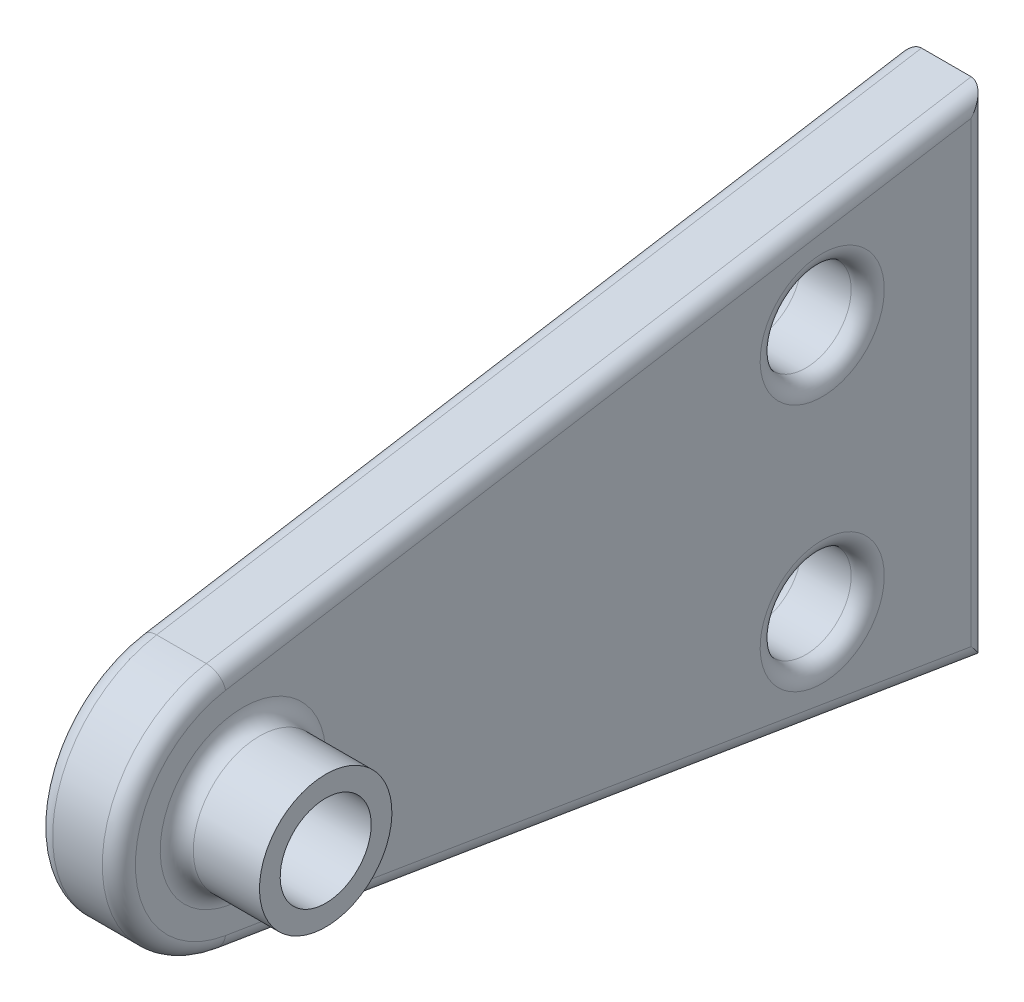
ISO-10303-21;
HEADER;
FILE_DESCRIPTION(('STEP AP214'),'2;1');
FILE_NAME('part.step','',(''),(''),'','','');
FILE_SCHEMA(('AUTOMOTIVE_DESIGN { 1 0 10303 214 1 1 1 1 }'));
ENDSEC;
DATA;
#1=APPLICATION_CONTEXT('core data for automotive mechanical design processes');
#2=APPLICATION_PROTOCOL_DEFINITION('international standard','automotive_design',2000,#1);
#3=PRODUCT_CONTEXT('',#1,'mechanical');
#4=PRODUCT('Part','Part','',(#3));
#5=PRODUCT_RELATED_PRODUCT_CATEGORY('part','',(#4));
#6=PRODUCT_DEFINITION_FORMATION('','',#4);
#7=PRODUCT_DEFINITION_CONTEXT('part definition',#1,'design');
#8=PRODUCT_DEFINITION('design','',#6,#7);
#9=PRODUCT_DEFINITION_SHAPE('','',#8);
#10=(LENGTH_UNIT() NAMED_UNIT(*) SI_UNIT(.MILLI.,.METRE.));
#11=(NAMED_UNIT(*) PLANE_ANGLE_UNIT() SI_UNIT($,.RADIAN.));
#12=(NAMED_UNIT(*) SI_UNIT($,.STERADIAN.) SOLID_ANGLE_UNIT());
#13=UNCERTAINTY_MEASURE_WITH_UNIT(LENGTH_MEASURE(1.E-05),#10,'distance_accuracy_value','');
#14=(GEOMETRIC_REPRESENTATION_CONTEXT(3) GLOBAL_UNCERTAINTY_ASSIGNED_CONTEXT((#13)) GLOBAL_UNIT_ASSIGNED_CONTEXT((#10,
#11,#12)) REPRESENTATION_CONTEXT('',''));
#15=CARTESIAN_POINT('',(0.,0.,0.));
#16=DIRECTION('',(0.,0.,1.));
#17=DIRECTION('',(1.,0.,0.));
#18=AXIS2_PLACEMENT_3D('',#15,#16,#17);
#19=CARTESIAN_POINT('',(5.,0.,45.));
#20=DIRECTION('',(-1.,0.,0.));
#21=DIRECTION('',(0.,1.,0.));
#22=AXIS2_PLACEMENT_3D('',#19,#20,#21);
#23=CYLINDRICAL_SURFACE('',#22,2.75);
#24=DIRECTION('',(1.,0.,0.));
#25=VECTOR('',#24,1.);
#26=CARTESIAN_POINT('',(5.,2.75,45.));
#27=LINE('',#26,#25);
#28=CARTESIAN_POINT('',(5.,2.75,45.));
#29=VERTEX_POINT('',#28);
#30=CARTESIAN_POINT('',(10.,2.75,45.));
#31=VERTEX_POINT('',#30);
#32=EDGE_CURVE('E10',#29,#31,#27,.T.);
#33=ORIENTED_EDGE('',*,*,#32,.T.);
#34=CARTESIAN_POINT('',(10.,0.,45.));
#35=DIRECTION('',(1.,0.,0.));
#36=DIRECTION('',(0.,1.,0.));
#37=AXIS2_PLACEMENT_3D('',#34,#35,#36);
#38=CIRCLE('',#37,2.75);
#39=EDGE_CURVE('E24',#31,#31,#38,.T.);
#40=ORIENTED_EDGE('',*,*,#39,.T.);
#41=ORIENTED_EDGE('',*,*,#32,.F.);
#42=CARTESIAN_POINT('',(5.,0.,45.));
#43=DIRECTION('',(1.,0.,0.));
#44=DIRECTION('',(0.,1.,0.));
#45=AXIS2_PLACEMENT_3D('',#42,#43,#44);
#46=CIRCLE('',#45,2.75);
#47=EDGE_CURVE('E371',#29,#29,#46,.T.);
#48=ORIENTED_EDGE('',*,*,#47,.F.);
#49=EDGE_LOOP('',(#33,#40,#41,#48));
#50=FACE_BOUND('',#49,.T.);
#51=ADVANCED_FACE('F16',(#50),#23,.F.);
#52=CARTESIAN_POINT('',(10.,0.,45.));
#53=DIRECTION('',(1.,0.,0.));
#54=DIRECTION('',(0.,-1.,0.));
#55=AXIS2_PLACEMENT_3D('',#52,#53,#54);
#56=PLANE('',#55);
#57=ORIENTED_EDGE('',*,*,#39,.F.);
#58=EDGE_LOOP('',(#57));
#59=FACE_BOUND('',#58,.T.);
#60=CARTESIAN_POINT('',(10.,0.,45.));
#61=DIRECTION('',(1.,0.,0.));
#62=DIRECTION('',(0.,1.,0.));
#63=AXIS2_PLACEMENT_3D('',#60,#61,#62);
#64=CIRCLE('',#63,4.);
#65=CARTESIAN_POINT('',(10.,4.,45.));
#66=VERTEX_POINT('',#65);
#67=EDGE_CURVE('E264',#66,#66,#64,.T.);
#68=ORIENTED_EDGE('',*,*,#67,.T.);
#69=EDGE_LOOP('',(#68));
#70=FACE_BOUND('',#69,.T.);
#71=ADVANCED_FACE('F378',(#59,#70),#56,.T.);
#72=CARTESIAN_POINT('',(0.,0.,45.));
#73=DIRECTION('',(-1.,0.,0.));
#74=DIRECTION('',(0.,1.,0.));
#75=AXIS2_PLACEMENT_3D('',#72,#73,#74);
#76=CYLINDRICAL_SURFACE('',#75,2.75);
#77=DIRECTION('',(1.,0.,0.));
#78=VECTOR('',#77,1.);
#79=CARTESIAN_POINT('',(0.,2.75,45.));
#80=LINE('',#79,#78);
#81=CARTESIAN_POINT('',(1.,2.75,45.));
#82=VERTEX_POINT('',#81);
#83=EDGE_CURVE('E301',#82,#29,#80,.T.);
#84=ORIENTED_EDGE('',*,*,#83,.T.);
#85=ORIENTED_EDGE('',*,*,#47,.T.);
#86=ORIENTED_EDGE('',*,*,#83,.F.);
#87=CARTESIAN_POINT('',(1.,0.,45.));
#88=DIRECTION('',(1.,0.,0.));
#89=DIRECTION('',(0.,1.,0.));
#90=AXIS2_PLACEMENT_3D('',#87,#88,#89);
#91=CIRCLE('',#90,2.75);
#92=EDGE_CURVE('E350',#82,#82,#91,.T.);
#93=ORIENTED_EDGE('',*,*,#92,.F.);
#94=EDGE_LOOP('',(#84,#85,#86,#93));
#95=FACE_BOUND('',#94,.T.);
#96=ADVANCED_FACE('F381',(#95),#76,.F.);
#97=CARTESIAN_POINT('',(5.,0.,45.));
#98=DIRECTION('',(-1.,0.,0.));
#99=DIRECTION('',(0.,1.,0.));
#100=AXIS2_PLACEMENT_3D('',#97,#98,#99);
#101=CYLINDRICAL_SURFACE('',#100,4.);
#102=CARTESIAN_POINT('',(6.,0.,45.));
#103=DIRECTION('',(1.,0.,0.));
#104=DIRECTION('',(0.,1.,0.));
#105=AXIS2_PLACEMENT_3D('',#102,#103,#104);
#106=CIRCLE('',#105,4.);
#107=CARTESIAN_POINT('',(6.,4.,45.));
#108=VERTEX_POINT('',#107);
#109=EDGE_CURVE('E346',#108,#108,#106,.T.);
#110=ORIENTED_EDGE('',*,*,#109,.T.);
#111=DIRECTION('',(1.,0.,0.));
#112=VECTOR('',#111,1.);
#113=CARTESIAN_POINT('',(5.,4.,45.));
#114=LINE('',#113,#112);
#115=EDGE_CURVE('E261',#108,#66,#114,.T.);
#116=ORIENTED_EDGE('',*,*,#115,.T.);
#117=ORIENTED_EDGE('',*,*,#67,.F.);
#118=ORIENTED_EDGE('',*,*,#115,.F.);
#119=EDGE_LOOP('',(#110,#116,#117,#118));
#120=FACE_BOUND('',#119,.T.);
#121=ADVANCED_FACE('F384',(#120),#101,.T.);
#122=CARTESIAN_POINT('',(0.,-7.5,10.));
#123=DIRECTION('',(-1.,0.,0.));
#124=DIRECTION('',(0.,1.,0.));
#125=AXIS2_PLACEMENT_3D('',#122,#123,#124);
#126=CYLINDRICAL_SURFACE('',#125,2.75);
#127=DIRECTION('',(1.,0.,0.));
#128=VECTOR('',#127,1.);
#129=CARTESIAN_POINT('',(0.,-4.75,10.));
#130=LINE('',#129,#128);
#131=CARTESIAN_POINT('',(1.,-4.75,10.));
#132=VERTEX_POINT('',#131);
#133=CARTESIAN_POINT('',(4.,-4.75,10.));
#134=VERTEX_POINT('',#133);
#135=EDGE_CURVE('E155',#132,#134,#130,.T.);
#136=ORIENTED_EDGE('',*,*,#135,.T.);
#137=CARTESIAN_POINT('',(4.,-7.5,10.));
#138=DIRECTION('',(1.,0.,0.));
#139=DIRECTION('',(0.,1.,0.));
#140=AXIS2_PLACEMENT_3D('',#137,#138,#139);
#141=CIRCLE('',#140,2.75);
#142=EDGE_CURVE('E342',#134,#134,#141,.T.);
#143=ORIENTED_EDGE('',*,*,#142,.T.);
#144=ORIENTED_EDGE('',*,*,#135,.F.);
#145=CARTESIAN_POINT('',(1.,-7.5,10.));
#146=DIRECTION('',(1.,0.,0.));
#147=DIRECTION('',(0.,1.,0.));
#148=AXIS2_PLACEMENT_3D('',#145,#146,#147);
#149=CIRCLE('',#148,2.75);
#150=EDGE_CURVE('E221',#132,#132,#149,.T.);
#151=ORIENTED_EDGE('',*,*,#150,.F.);
#152=EDGE_LOOP('',(#136,#143,#144,#151));
#153=FACE_BOUND('',#152,.T.);
#154=ADVANCED_FACE('F765',(#153),#126,.F.);
#155=CARTESIAN_POINT('',(0.,7.5,10.));
#156=DIRECTION('',(-1.,0.,0.));
#157=DIRECTION('',(0.,1.,0.));
#158=AXIS2_PLACEMENT_3D('',#155,#156,#157);
#159=CYLINDRICAL_SURFACE('',#158,2.75);
#160=DIRECTION('',(1.,0.,0.));
#161=VECTOR('',#160,1.);
#162=CARTESIAN_POINT('',(0.,10.25,10.));
#163=LINE('',#162,#161);
#164=CARTESIAN_POINT('',(1.,10.25,10.));
#165=VERTEX_POINT('',#164);
#166=CARTESIAN_POINT('',(4.,10.25,10.));
#167=VERTEX_POINT('',#166);
#168=EDGE_CURVE('E144',#165,#167,#163,.T.);
#169=ORIENTED_EDGE('',*,*,#168,.T.);
#170=CARTESIAN_POINT('',(4.,7.5,10.));
#171=DIRECTION('',(1.,0.,0.));
#172=DIRECTION('',(0.,1.,0.));
#173=AXIS2_PLACEMENT_3D('',#170,#171,#172);
#174=CIRCLE('',#173,2.75);
#175=EDGE_CURVE('E253',#167,#167,#174,.T.);
#176=ORIENTED_EDGE('',*,*,#175,.T.);
#177=ORIENTED_EDGE('',*,*,#168,.F.);
#178=CARTESIAN_POINT('',(1.,7.5,10.));
#179=DIRECTION('',(1.,0.,0.));
#180=DIRECTION('',(0.,1.,0.));
#181=AXIS2_PLACEMENT_3D('',#178,#179,#180);
#182=CIRCLE('',#181,2.75);
#183=EDGE_CURVE('E220',#165,#165,#182,.T.);
#184=ORIENTED_EDGE('',*,*,#183,.F.);
#185=EDGE_LOOP('',(#169,#176,#177,#184));
#186=FACE_BOUND('',#185,.T.);
#187=ADVANCED_FACE('F754',(#186),#159,.F.);
#188=CARTESIAN_POINT('',(1.,7.5,10.));
#189=DIRECTION('',(-1.,0.,0.));
#190=DIRECTION('',(0.,1.,0.));
#191=AXIS2_PLACEMENT_3D('',#188,#189,#190);
#192=TOROIDAL_SURFACE('',#191,3.75,1.);
#193=ORIENTED_EDGE('',*,*,#183,.T.);
#194=CARTESIAN_POINT('',(1.,11.25,10.));
#195=DIRECTION('',(0.,0.,1.));
#196=DIRECTION('',(0.,1.,0.));
#197=AXIS2_PLACEMENT_3D('',#194,#195,#196);
#198=CIRCLE('',#197,1.);
#199=CARTESIAN_POINT('',(0.,11.25,10.));
#200=VERTEX_POINT('',#199);
#201=EDGE_CURVE('E247',#200,#165,#198,.T.);
#202=ORIENTED_EDGE('',*,*,#201,.F.);
#203=CARTESIAN_POINT('',(0.,7.5,10.));
#204=DIRECTION('',(1.,0.,0.));
#205=DIRECTION('',(0.,1.,0.));
#206=AXIS2_PLACEMENT_3D('',#203,#204,#205);
#207=CIRCLE('',#206,3.75);
#208=EDGE_CURVE('E306',#200,#200,#207,.T.);
#209=ORIENTED_EDGE('',*,*,#208,.F.);
#210=ORIENTED_EDGE('',*,*,#201,.T.);
#211=EDGE_LOOP('',(#193,#202,#209,#210));
#212=FACE_BOUND('',#211,.T.);
#213=ADVANCED_FACE('F707',(#212),#192,.T.);
#214=CARTESIAN_POINT('',(1.,-7.5,10.));
#215=DIRECTION('',(-1.,0.,0.));
#216=DIRECTION('',(0.,1.,0.));
#217=AXIS2_PLACEMENT_3D('',#214,#215,#216);
#218=TOROIDAL_SURFACE('',#217,3.75,1.);
#219=ORIENTED_EDGE('',*,*,#150,.T.);
#220=CARTESIAN_POINT('',(1.,-3.75,10.));
#221=DIRECTION('',(0.,0.,1.));
#222=DIRECTION('',(0.,1.,0.));
#223=AXIS2_PLACEMENT_3D('',#220,#221,#222);
#224=CIRCLE('',#223,1.);
#225=CARTESIAN_POINT('',(0.,-3.75,10.));
#226=VERTEX_POINT('',#225);
#227=EDGE_CURVE('E217',#226,#132,#224,.T.);
#228=ORIENTED_EDGE('',*,*,#227,.F.);
#229=CARTESIAN_POINT('',(0.,-7.5,10.));
#230=DIRECTION('',(1.,0.,0.));
#231=DIRECTION('',(0.,1.,0.));
#232=AXIS2_PLACEMENT_3D('',#229,#230,#231);
#233=CIRCLE('',#232,3.75);
#234=EDGE_CURVE('E310',#226,#226,#233,.T.);
#235=ORIENTED_EDGE('',*,*,#234,.F.);
#236=ORIENTED_EDGE('',*,*,#227,.T.);
#237=EDGE_LOOP('',(#219,#228,#235,#236));
#238=FACE_BOUND('',#237,.T.);
#239=ADVANCED_FACE('F702',(#238),#218,.T.);
#240=CARTESIAN_POINT('',(1.,0.,45.));
#241=DIRECTION('',(-1.,0.,0.));
#242=DIRECTION('',(0.,1.,0.));
#243=AXIS2_PLACEMENT_3D('',#240,#241,#242);
#244=TOROIDAL_SURFACE('',#243,3.75,1.);
#245=ORIENTED_EDGE('',*,*,#92,.T.);
#246=CARTESIAN_POINT('',(1.,3.75,45.));
#247=DIRECTION('',(0.,0.,1.));
#248=DIRECTION('',(0.,1.,0.));
#249=AXIS2_PLACEMENT_3D('',#246,#247,#248);
#250=CIRCLE('',#249,1.);
#251=CARTESIAN_POINT('',(0.,3.75,45.));
#252=VERTEX_POINT('',#251);
#253=EDGE_CURVE('E354',#252,#82,#250,.T.);
#254=ORIENTED_EDGE('',*,*,#253,.F.);
#255=CARTESIAN_POINT('',(0.,0.,45.));
#256=DIRECTION('',(1.,0.,0.));
#257=DIRECTION('',(0.,1.,0.));
#258=AXIS2_PLACEMENT_3D('',#255,#256,#257);
#259=CIRCLE('',#258,3.75);
#260=EDGE_CURVE('E327',#252,#252,#259,.T.);
#261=ORIENTED_EDGE('',*,*,#260,.F.);
#262=ORIENTED_EDGE('',*,*,#253,.T.);
#263=EDGE_LOOP('',(#245,#254,#261,#262));
#264=FACE_BOUND('',#263,.T.);
#265=ADVANCED_FACE('F673',(#264),#244,.T.);
#266=CARTESIAN_POINT('',(6.,0.,45.));
#267=DIRECTION('',(-1.,0.,0.));
#268=DIRECTION('',(0.,1.,0.));
#269=AXIS2_PLACEMENT_3D('',#266,#267,#268);
#270=TOROIDAL_SURFACE('',#269,5.,1.);
#271=CARTESIAN_POINT('',(6.,5.,45.));
#272=DIRECTION('',(0.,0.,1.));
#273=DIRECTION('',(0.,1.,0.));
#274=AXIS2_PLACEMENT_3D('',#271,#272,#273);
#275=CIRCLE('',#274,1.);
#276=CARTESIAN_POINT('',(5.,5.,45.));
#277=VERTEX_POINT('',#276);
#278=EDGE_CURVE('E345',#277,#108,#275,.T.);
#279=ORIENTED_EDGE('',*,*,#278,.F.);
#280=CARTESIAN_POINT('',(5.,0.,45.));
#281=DIRECTION('',(1.,0.,0.));
#282=DIRECTION('',(0.,1.,0.));
#283=AXIS2_PLACEMENT_3D('',#280,#281,#282);
#284=CIRCLE('',#283,5.);
#285=EDGE_CURVE('E314',#277,#277,#284,.T.);
#286=ORIENTED_EDGE('',*,*,#285,.T.);
#287=ORIENTED_EDGE('',*,*,#278,.T.);
#288=ORIENTED_EDGE('',*,*,#109,.F.);
#289=EDGE_LOOP('',(#279,#286,#287,#288));
#290=FACE_BOUND('',#289,.T.);
#291=ADVANCED_FACE('F388',(#290),#270,.F.);
#292=CARTESIAN_POINT('',(4.,-7.5,10.));
#293=DIRECTION('',(1.,0.,0.));
#294=DIRECTION('',(0.,1.,0.));
#295=AXIS2_PLACEMENT_3D('',#292,#293,#294);
#296=TOROIDAL_SURFACE('',#295,3.75,1.);
#297=CARTESIAN_POINT('',(4.,-3.75,10.));
#298=DIRECTION('',(0.,0.,-1.));
#299=DIRECTION('',(0.,1.,0.));
#300=AXIS2_PLACEMENT_3D('',#297,#298,#299);
#301=CIRCLE('',#300,1.);
#302=CARTESIAN_POINT('',(5.,-3.75,10.));
#303=VERTEX_POINT('',#302);
#304=EDGE_CURVE('E256',#303,#134,#301,.T.);
#305=ORIENTED_EDGE('',*,*,#304,.F.);
#306=CARTESIAN_POINT('',(5.,-7.5,10.));
#307=DIRECTION('',(1.,0.,0.));
#308=DIRECTION('',(0.,1.,0.));
#309=AXIS2_PLACEMENT_3D('',#306,#307,#308);
#310=CIRCLE('',#309,3.75);
#311=EDGE_CURVE('E305',#303,#303,#310,.T.);
#312=ORIENTED_EDGE('',*,*,#311,.T.);
#313=ORIENTED_EDGE('',*,*,#304,.T.);
#314=ORIENTED_EDGE('',*,*,#142,.F.);
#315=EDGE_LOOP('',(#305,#312,#313,#314));
#316=FACE_BOUND('',#315,.T.);
#317=ADVANCED_FACE('F615',(#316),#296,.T.);
#318=CARTESIAN_POINT('',(4.,7.5,10.));
#319=DIRECTION('',(1.,0.,0.));
#320=DIRECTION('',(0.,1.,0.));
#321=AXIS2_PLACEMENT_3D('',#318,#319,#320);
#322=TOROIDAL_SURFACE('',#321,3.75,1.);
#323=CARTESIAN_POINT('',(4.,11.25,10.));
#324=DIRECTION('',(0.,0.,-1.));
#325=DIRECTION('',(0.,1.,0.));
#326=AXIS2_PLACEMENT_3D('',#323,#324,#325);
#327=CIRCLE('',#326,1.);
#328=CARTESIAN_POINT('',(5.,11.25,10.));
#329=VERTEX_POINT('',#328);
#330=EDGE_CURVE('E257',#329,#167,#327,.T.);
#331=ORIENTED_EDGE('',*,*,#330,.F.);
#332=CARTESIAN_POINT('',(5.,7.5,10.));
#333=DIRECTION('',(1.,0.,0.));
#334=DIRECTION('',(0.,1.,0.));
#335=AXIS2_PLACEMENT_3D('',#332,#333,#334);
#336=CIRCLE('',#335,3.75);
#337=EDGE_CURVE('E298',#329,#329,#336,.T.);
#338=ORIENTED_EDGE('',*,*,#337,.T.);
#339=ORIENTED_EDGE('',*,*,#330,.T.);
#340=ORIENTED_EDGE('',*,*,#175,.F.);
#341=EDGE_LOOP('',(#331,#338,#339,#340));
#342=FACE_BOUND('',#341,.T.);
#343=ADVANCED_FACE('F609',(#342),#322,.T.);
#344=CARTESIAN_POINT('',(1.,0.,45.));
#345=DIRECTION('',(-1.,0.,0.));
#346=DIRECTION('',(0.,0.986749699759753,0.16224989991996));
#347=AXIS2_PLACEMENT_3D('',#344,#345,#346);
#348=TOROIDAL_SURFACE('',#347,6.5,1.);
#349=CARTESIAN_POINT('',(0.,0.,45.));
#350=DIRECTION('',(1.,0.,0.));
#351=DIRECTION('',(0.,0.986749699759753,0.16224989991996));
#352=AXIS2_PLACEMENT_3D('',#349,#350,#351);
#353=CIRCLE('',#352,6.5);
#354=CARTESIAN_POINT('',(0.,6.413873048438,46.054624349479));
#355=VERTEX_POINT('',#354);
#356=CARTESIAN_POINT('',(0.,-6.413873048438,46.054624349479));
#357=VERTEX_POINT('',#356);
#358=EDGE_CURVE('E321',#355,#357,#353,.T.);
#359=ORIENTED_EDGE('',*,*,#358,.T.);
#360=CARTESIAN_POINT('',(1.,-6.413873048438,46.054624349479));
#361=DIRECTION('',(0.,-0.16224989991996,-0.986749699759753));
#362=DIRECTION('',(0.,-0.986749699759753,0.16224989991996));
#363=AXIS2_PLACEMENT_3D('',#360,#361,#362);
#364=CIRCLE('',#363,1.);
#365=CARTESIAN_POINT('',(1.,-7.400622748198,46.216874249399));
#366=VERTEX_POINT('',#365);
#367=EDGE_CURVE('E276',#366,#357,#364,.T.);
#368=ORIENTED_EDGE('',*,*,#367,.F.);
#369=CARTESIAN_POINT('',(1.,0.,45.));
#370=DIRECTION('',(1.,0.,0.));
#371=DIRECTION('',(0.,0.986749699759753,0.16224989991996));
#372=AXIS2_PLACEMENT_3D('',#369,#370,#371);
#373=CIRCLE('',#372,7.5);
#374=CARTESIAN_POINT('',(1.,7.400622748198,46.216874249399));
#375=VERTEX_POINT('',#374);
#376=EDGE_CURVE('E284',#375,#366,#373,.T.);
#377=ORIENTED_EDGE('',*,*,#376,.F.);
#378=CARTESIAN_POINT('',(1.,6.413873048438,46.054624349479));
#379=DIRECTION('',(0.,-0.16224989991996,0.986749699759753));
#380=DIRECTION('',(0.,0.986749699759753,0.16224989991996));
#381=AXIS2_PLACEMENT_3D('',#378,#379,#380);
#382=CIRCLE('',#381,1.);
#383=EDGE_CURVE('E173',#375,#355,#382,.T.);
#384=ORIENTED_EDGE('',*,*,#383,.T.);
#385=EDGE_LOOP('',(#359,#368,#377,#384));
#386=FACE_BOUND('',#385,.T.);
#387=ADVANCED_FACE('F614',(#386),#348,.T.);
#388=CARTESIAN_POINT('',(4.,0.,45.));
#389=DIRECTION('',(1.,0.,0.));
#390=DIRECTION('',(0.,-0.986749699759753,0.16224989991996));
#391=AXIS2_PLACEMENT_3D('',#388,#389,#390);
#392=TOROIDAL_SURFACE('',#391,6.5,1.);
#393=CARTESIAN_POINT('',(5.,0.,45.));
#394=DIRECTION('',(-1.,0.,0.));
#395=DIRECTION('',(0.,-0.986749699759753,0.16224989991996));
#396=AXIS2_PLACEMENT_3D('',#393,#394,#395);
#397=CIRCLE('',#396,6.5);
#398=CARTESIAN_POINT('',(5.,-6.413873048438,46.05462434948));
#399=VERTEX_POINT('',#398);
#400=CARTESIAN_POINT('',(5.,6.413873048438,46.054624349479));
#401=VERTEX_POINT('',#400);
#402=EDGE_CURVE('E294',#399,#401,#397,.T.);
#403=ORIENTED_EDGE('',*,*,#402,.T.);
#404=CARTESIAN_POINT('',(4.,6.413873048438,46.054624349479));
#405=DIRECTION('',(0.,0.16224989991996,-0.986749699759753));
#406=DIRECTION('',(0.,0.986749699759753,0.16224989991996));
#407=AXIS2_PLACEMENT_3D('',#404,#405,#406);
#408=CIRCLE('',#407,1.);
#409=CARTESIAN_POINT('',(4.,7.400622748198,46.216874249399));
#410=VERTEX_POINT('',#409);
#411=EDGE_CURVE('E318',#410,#401,#408,.T.);
#412=ORIENTED_EDGE('',*,*,#411,.F.);
#413=CARTESIAN_POINT('',(4.,0.,45.));
#414=DIRECTION('',(-1.,0.,0.));
#415=DIRECTION('',(0.,-0.986749699759753,0.16224989991996));
#416=AXIS2_PLACEMENT_3D('',#413,#414,#415);
#417=CIRCLE('',#416,7.5);
#418=CARTESIAN_POINT('',(4.,-7.400622748198,46.216874249399));
#419=VERTEX_POINT('',#418);
#420=EDGE_CURVE('E287',#419,#410,#417,.T.);
#421=ORIENTED_EDGE('',*,*,#420,.F.);
#422=CARTESIAN_POINT('',(4.,-6.413873048438,46.05462434948));
#423=DIRECTION('',(0.,0.16224989991996,0.986749699759753));
#424=DIRECTION('',(0.,-0.986749699759753,0.16224989991996));
#425=AXIS2_PLACEMENT_3D('',#422,#423,#424);
#426=CIRCLE('',#425,1.);
#427=EDGE_CURVE('E272',#419,#399,#426,.T.);
#428=ORIENTED_EDGE('',*,*,#427,.T.);
#429=EDGE_LOOP('',(#403,#412,#421,#428));
#430=FACE_BOUND('',#429,.T.);
#431=ADVANCED_FACE('F591',(#430),#392,.T.);
#432=CARTESIAN_POINT('',(1.,14.01325030024,-0.16224989992));
#433=DIRECTION('',(0.,-0.16224989991996,0.986749699759753));
#434=DIRECTION('',(0.,0.986749699759753,0.16224989991996));
#435=AXIS2_PLACEMENT_3D('',#432,#433,#434);
#436=CYLINDRICAL_SURFACE('',#435,1.);
#437=CARTESIAN_POINT('',(1.,13.822143143086,1.));
#438=DIRECTION('',(0.,0.647205570155314,0.762315518640369));
#439=DIRECTION('',(0.,0.762315518640369,-0.647205570155314));
#440=AXIS2_PLACEMENT_3D('',#437,#438,#439);
#441=ELLIPSE('',#440,1.545104130918,1.);
#442=CARTESIAN_POINT('',(1.,15.,0.));
#443=VERTEX_POINT('',#442);
#444=CARTESIAN_POINT('',(0.,13.822143143086,1.));
#445=VERTEX_POINT('',#444);
#446=EDGE_CURVE('E171',#443,#445,#441,.T.);
#447=ORIENTED_EDGE('',*,*,#446,.T.);
#448=DIRECTION('',(0.,-0.16224989991996,0.986749699759753));
#449=VECTOR('',#448,1.);
#450=CARTESIAN_POINT('',(0.,14.01325030024,-0.16224989992));
#451=LINE('',#450,#449);
#452=EDGE_CURVE('E324',#445,#355,#451,.T.);
#453=ORIENTED_EDGE('',*,*,#452,.T.);
#454=ORIENTED_EDGE('',*,*,#383,.F.);
#455=DIRECTION('',(0.,-0.16224989991996,0.986749699759753));
#456=VECTOR('',#455,1.);
#457=CARTESIAN_POINT('',(1.,15.,0.));
#458=LINE('',#457,#456);
#459=EDGE_CURVE('E167',#443,#375,#458,.T.);
#460=ORIENTED_EDGE('',*,*,#459,.F.);
#461=EDGE_LOOP('',(#447,#453,#454,#460));
#462=FACE_BOUND('',#461,.T.);
#463=ADVANCED_FACE('F169',(#462),#436,.T.);
#464=CARTESIAN_POINT('',(0.,0.,21.981918553063));
#465=DIRECTION('',(1.,0.,0.));
#466=DIRECTION('',(0.,-1.,0.));
#467=AXIS2_PLACEMENT_3D('',#464,#465,#466);
#468=PLANE('',#467);
#469=ORIENTED_EDGE('',*,*,#208,.T.);
#470=EDGE_LOOP('',(#469));
#471=FACE_BOUND('',#470,.T.);
#472=ORIENTED_EDGE('',*,*,#234,.T.);
#473=EDGE_LOOP('',(#472));
#474=FACE_BOUND('',#473,.T.);
#475=ORIENTED_EDGE('',*,*,#260,.T.);
#476=EDGE_LOOP('',(#475));
#477=FACE_BOUND('',#476,.T.);
#478=DIRECTION('',(0.,-0.16224989991996,-0.986749699759753));
#479=VECTOR('',#478,1.);
#480=CARTESIAN_POINT('',(0.,-6.413873048438,46.05462434948));
#481=LINE('',#480,#479);
#482=CARTESIAN_POINT('',(0.,-13.82214314308,1.));
#483=VERTEX_POINT('',#482);
#484=EDGE_CURVE('E280',#357,#483,#481,.T.);
#485=ORIENTED_EDGE('',*,*,#484,.F.);
#486=ORIENTED_EDGE('',*,*,#358,.F.);
#487=ORIENTED_EDGE('',*,*,#452,.F.);
#488=DIRECTION('',(0.,1.,0.));
#489=VECTOR('',#488,1.);
#490=CARTESIAN_POINT('',(0.,-15.,1.));
#491=LINE('',#490,#489);
#492=EDGE_CURVE('E188',#483,#445,#491,.T.);
#493=ORIENTED_EDGE('',*,*,#492,.F.);
#494=EDGE_LOOP('',(#485,#486,#487,#493));
#495=FACE_BOUND('',#494,.T.);
#496=ADVANCED_FACE('F590',(#471,#474,#477,#495),#468,.F.);
#497=CARTESIAN_POINT('',(4.,6.413873048438,46.054624349479));
#498=DIRECTION('',(0.,0.16224989991996,-0.986749699759753));
#499=DIRECTION('',(0.,0.986749699759753,0.16224989991996));
#500=AXIS2_PLACEMENT_3D('',#497,#498,#499);
#501=CYLINDRICAL_SURFACE('',#500,1.);
#502=ORIENTED_EDGE('',*,*,#411,.T.);
#503=DIRECTION('',(0.,0.16224989991996,-0.986749699759753));
#504=VECTOR('',#503,1.);
#505=CARTESIAN_POINT('',(5.,6.413873048438,46.054624349479));
#506=LINE('',#505,#504);
#507=CARTESIAN_POINT('',(5.,13.822143143086,1.));
#508=VERTEX_POINT('',#507);
#509=EDGE_CURVE('E291',#401,#508,#506,.T.);
#510=ORIENTED_EDGE('',*,*,#509,.T.);
#511=CARTESIAN_POINT('',(4.,13.822143143086,1.));
#512=DIRECTION('',(0.,-0.647205570155314,-0.762315518640369));
#513=DIRECTION('',(0.,0.762315518640369,-0.647205570155314));
#514=AXIS2_PLACEMENT_3D('',#511,#512,#513);
#515=ELLIPSE('',#514,1.545104130918,1.);
#516=CARTESIAN_POINT('',(4.,15.,0.));
#517=VERTEX_POINT('',#516);
#518=EDGE_CURVE('E230',#517,#508,#515,.T.);
#519=ORIENTED_EDGE('',*,*,#518,.F.);
#520=DIRECTION('',(0.,0.16224989991996,-0.986749699759753));
#521=VECTOR('',#520,1.);
#522=CARTESIAN_POINT('',(4.,7.400622748198,46.216874249399));
#523=LINE('',#522,#521);
#524=EDGE_CURVE('E195',#410,#517,#523,.T.);
#525=ORIENTED_EDGE('',*,*,#524,.F.);
#526=EDGE_LOOP('',(#502,#510,#519,#525));
#527=FACE_BOUND('',#526,.T.);
#528=ADVANCED_FACE('F694',(#527),#501,.T.);
#529=CARTESIAN_POINT('',(5.,0.,21.981918553063));
#530=DIRECTION('',(1.,0.,0.));
#531=DIRECTION('',(0.,-1.,0.));
#532=AXIS2_PLACEMENT_3D('',#529,#530,#531);
#533=PLANE('',#532);
#534=ORIENTED_EDGE('',*,*,#285,.F.);
#535=EDGE_LOOP('',(#534));
#536=FACE_BOUND('',#535,.T.);
#537=ORIENTED_EDGE('',*,*,#311,.F.);
#538=EDGE_LOOP('',(#537));
#539=FACE_BOUND('',#538,.T.);
#540=ORIENTED_EDGE('',*,*,#337,.F.);
#541=EDGE_LOOP('',(#540));
#542=FACE_BOUND('',#541,.T.);
#543=DIRECTION('',(0.,1.,0.));
#544=VECTOR('',#543,1.);
#545=CARTESIAN_POINT('',(5.,-15.,1.));
#546=LINE('',#545,#544);
#547=CARTESIAN_POINT('',(5.,-13.82214314308,1.));
#548=VERTEX_POINT('',#547);
#549=EDGE_CURVE('E225',#548,#508,#546,.T.);
#550=ORIENTED_EDGE('',*,*,#549,.T.);
#551=ORIENTED_EDGE('',*,*,#509,.F.);
#552=ORIENTED_EDGE('',*,*,#402,.F.);
#553=DIRECTION('',(0.,0.16224989991996,0.986749699759753));
#554=VECTOR('',#553,1.);
#555=CARTESIAN_POINT('',(5.,-14.01325030024,-0.16224989992));
#556=LINE('',#555,#554);
#557=EDGE_CURVE('E268',#548,#399,#556,.T.);
#558=ORIENTED_EDGE('',*,*,#557,.F.);
#559=EDGE_LOOP('',(#550,#551,#552,#558));
#560=FACE_BOUND('',#559,.T.);
#561=ADVANCED_FACE('F683',(#536,#539,#542,#560),#533,.T.);
#562=CARTESIAN_POINT('',(0.,0.,45.));
#563=DIRECTION('',(-1.,0.,0.));
#564=DIRECTION('',(0.,1.,0.));
#565=AXIS2_PLACEMENT_3D('',#562,#563,#564);
#566=CYLINDRICAL_SURFACE('',#565,7.5);
#567=ORIENTED_EDGE('',*,*,#376,.T.);
#568=DIRECTION('',(1.,0.,0.));
#569=VECTOR('',#568,1.);
#570=CARTESIAN_POINT('',(0.,-7.400622748198,46.216874249399));
#571=LINE('',#570,#569);
#572=EDGE_CURVE('E237',#366,#419,#571,.T.);
#573=ORIENTED_EDGE('',*,*,#572,.T.);
#574=ORIENTED_EDGE('',*,*,#420,.T.);
#575=DIRECTION('',(1.,0.,0.));
#576=VECTOR('',#575,1.);
#577=CARTESIAN_POINT('',(0.,7.400622748198,46.216874249399));
#578=LINE('',#577,#576);
#579=EDGE_CURVE('E179',#375,#410,#578,.T.);
#580=ORIENTED_EDGE('',*,*,#579,.F.);
#581=EDGE_LOOP('',(#567,#573,#574,#580));
#582=FACE_BOUND('',#581,.T.);
#583=ADVANCED_FACE('F652',(#582),#566,.T.);
#584=CARTESIAN_POINT('',(1.,-6.413873048438,46.05462434948));
#585=DIRECTION('',(0.,-0.16224989991996,-0.986749699759753));
#586=DIRECTION('',(0.,-0.986749699759753,0.16224989991996));
#587=AXIS2_PLACEMENT_3D('',#584,#585,#586);
#588=CYLINDRICAL_SURFACE('',#587,1.);
#589=ORIENTED_EDGE('',*,*,#367,.T.);
#590=ORIENTED_EDGE('',*,*,#484,.T.);
#591=CARTESIAN_POINT('',(1.,-13.82214314308,1.));
#592=DIRECTION('',(0.,0.647205570155314,-0.762315518640369));
#593=DIRECTION('',(0.,0.762315518640369,0.647205570155314));
#594=AXIS2_PLACEMENT_3D('',#591,#592,#593);
#595=ELLIPSE('',#594,1.545104130918,1.);
#596=CARTESIAN_POINT('',(1.,-15.,0.));
#597=VERTEX_POINT('',#596);
#598=EDGE_CURVE('E215',#597,#483,#595,.T.);
#599=ORIENTED_EDGE('',*,*,#598,.F.);
#600=DIRECTION('',(0.,-0.16224989991996,-0.986749699759753));
#601=VECTOR('',#600,1.);
#602=CARTESIAN_POINT('',(1.,-7.400622748198,46.216874249399));
#603=LINE('',#602,#601);
#604=EDGE_CURVE('E241',#366,#597,#603,.T.);
#605=ORIENTED_EDGE('',*,*,#604,.F.);
#606=EDGE_LOOP('',(#589,#590,#599,#605));
#607=FACE_BOUND('',#606,.T.);
#608=ADVANCED_FACE('F566',(#607),#588,.T.);
#609=CARTESIAN_POINT('',(4.,-14.01325030024,-0.16224989992));
#610=DIRECTION('',(0.,0.16224989991996,0.986749699759753));
#611=DIRECTION('',(0.,-0.986749699759753,0.16224989991996));
#612=AXIS2_PLACEMENT_3D('',#609,#610,#611);
#613=CYLINDRICAL_SURFACE('',#612,1.);
#614=CARTESIAN_POINT('',(4.,-13.82214314308,1.));
#615=DIRECTION('',(0.,-0.647205570155314,0.762315518640369));
#616=DIRECTION('',(0.,0.762315518640369,0.647205570155314));
#617=AXIS2_PLACEMENT_3D('',#614,#615,#616);
#618=ELLIPSE('',#617,1.545104130918,1.);
#619=CARTESIAN_POINT('',(4.,-15.,0.));
#620=VERTEX_POINT('',#619);
#621=EDGE_CURVE('E229',#620,#548,#618,.T.);
#622=ORIENTED_EDGE('',*,*,#621,.T.);
#623=ORIENTED_EDGE('',*,*,#557,.T.);
#624=ORIENTED_EDGE('',*,*,#427,.F.);
#625=DIRECTION('',(0.,0.16224989991996,0.986749699759753));
#626=VECTOR('',#625,1.);
#627=CARTESIAN_POINT('',(4.,-15.,0.));
#628=LINE('',#627,#626);
#629=EDGE_CURVE('E233',#620,#419,#628,.T.);
#630=ORIENTED_EDGE('',*,*,#629,.F.);
#631=EDGE_LOOP('',(#622,#623,#624,#630));
#632=FACE_BOUND('',#631,.T.);
#633=ADVANCED_FACE('F561',(#632),#613,.T.);
#634=CARTESIAN_POINT('',(0.,15.,0.));
#635=DIRECTION('',(0.,-0.986749699759753,-0.16224989991996));
#636=DIRECTION('',(0.,0.16224989991996,-0.986749699759753));
#637=AXIS2_PLACEMENT_3D('',#634,#635,#636);
#638=PLANE('',#637);
#639=ORIENTED_EDGE('',*,*,#459,.T.);
#640=ORIENTED_EDGE('',*,*,#579,.T.);
#641=ORIENTED_EDGE('',*,*,#524,.T.);
#642=DIRECTION('',(1.,0.,0.));
#643=VECTOR('',#642,1.);
#644=CARTESIAN_POINT('',(0.,15.,0.));
#645=LINE('',#644,#643);
#646=EDGE_CURVE('E192',#443,#517,#645,.T.);
#647=ORIENTED_EDGE('',*,*,#646,.F.);
#648=EDGE_LOOP('',(#639,#640,#641,#647));
#649=FACE_BOUND('',#648,.T.);
#650=ADVANCED_FACE('F193',(#649),#638,.F.);
#651=CARTESIAN_POINT('',(1.,-15.,1.));
#652=DIRECTION('',(0.,1.,0.));
#653=DIRECTION('',(0.,0.,-1.));
#654=AXIS2_PLACEMENT_3D('',#651,#652,#653);
#655=CYLINDRICAL_SURFACE('',#654,1.);
#656=ORIENTED_EDGE('',*,*,#598,.T.);
#657=ORIENTED_EDGE('',*,*,#492,.T.);
#658=ORIENTED_EDGE('',*,*,#446,.F.);
#659=DIRECTION('',(0.,1.,0.));
#660=VECTOR('',#659,1.);
#661=CARTESIAN_POINT('',(1.,-15.,0.));
#662=LINE('',#661,#660);
#663=EDGE_CURVE('E186',#597,#443,#662,.T.);
#664=ORIENTED_EDGE('',*,*,#663,.F.);
#665=EDGE_LOOP('',(#656,#657,#658,#664));
#666=FACE_BOUND('',#665,.T.);
#667=ADVANCED_FACE('F184',(#666),#655,.T.);
#668=CARTESIAN_POINT('',(4.,-15.,1.));
#669=DIRECTION('',(0.,1.,0.));
#670=DIRECTION('',(0.,0.,-1.));
#671=AXIS2_PLACEMENT_3D('',#668,#669,#670);
#672=CYLINDRICAL_SURFACE('',#671,1.);
#673=DIRECTION('',(0.,1.,0.));
#674=VECTOR('',#673,1.);
#675=CARTESIAN_POINT('',(4.,-15.,0.));
#676=LINE('',#675,#674);
#677=EDGE_CURVE('E200',#620,#517,#676,.T.);
#678=ORIENTED_EDGE('',*,*,#677,.T.);
#679=ORIENTED_EDGE('',*,*,#518,.T.);
#680=ORIENTED_EDGE('',*,*,#549,.F.);
#681=ORIENTED_EDGE('',*,*,#621,.F.);
#682=EDGE_LOOP('',(#678,#679,#680,#681));
#683=FACE_BOUND('',#682,.T.);
#684=ADVANCED_FACE('F578',(#683),#672,.T.);
#685=CARTESIAN_POINT('',(0.,-15.,0.));
#686=DIRECTION('',(0.,-0.986749699759753,0.16224989991996));
#687=DIRECTION('',(-1.,0.,0.));
#688=AXIS2_PLACEMENT_3D('',#685,#686,#687);
#689=PLANE('',#688);
#690=DIRECTION('',(1.,0.,0.));
#691=VECTOR('',#690,1.);
#692=CARTESIAN_POINT('',(0.,-15.,0.));
#693=LINE('',#692,#691);
#694=EDGE_CURVE('E205',#597,#620,#693,.T.);
#695=ORIENTED_EDGE('',*,*,#694,.T.);
#696=ORIENTED_EDGE('',*,*,#629,.T.);
#697=ORIENTED_EDGE('',*,*,#572,.F.);
#698=ORIENTED_EDGE('',*,*,#604,.T.);
#699=EDGE_LOOP('',(#695,#696,#697,#698));
#700=FACE_BOUND('',#699,.T.);
#701=ADVANCED_FACE('F553',(#700),#689,.T.);
#702=CARTESIAN_POINT('',(0.,-15.,0.));
#703=DIRECTION('',(0.,0.,1.));
#704=DIRECTION('',(1.,0.,0.));
#705=AXIS2_PLACEMENT_3D('',#702,#703,#704);
#706=PLANE('',#705);
#707=ORIENTED_EDGE('',*,*,#663,.T.);
#708=ORIENTED_EDGE('',*,*,#646,.T.);
#709=ORIENTED_EDGE('',*,*,#677,.F.);
#710=ORIENTED_EDGE('',*,*,#694,.F.);
#711=EDGE_LOOP('',(#707,#708,#709,#710));
#712=FACE_BOUND('',#711,.T.);
#713=ADVANCED_FACE('F203',(#712),#706,.F.);
#714=CLOSED_SHELL('',(#51,#71,#96,#121,#154,#187,#213,#239,#265,#291,#317,#343,#387,#431,#463,
#496,#528,#561,#583,#608,#633,#650,#667,#684,#701,#713));
#715=MANIFOLD_SOLID_BREP('B1',#714);
#716=ADVANCED_BREP_SHAPE_REPRESENTATION('',(#18,#715),#14);
#717=SHAPE_DEFINITION_REPRESENTATION(#9,#716);
ENDSEC;
END-ISO-10303-21;
